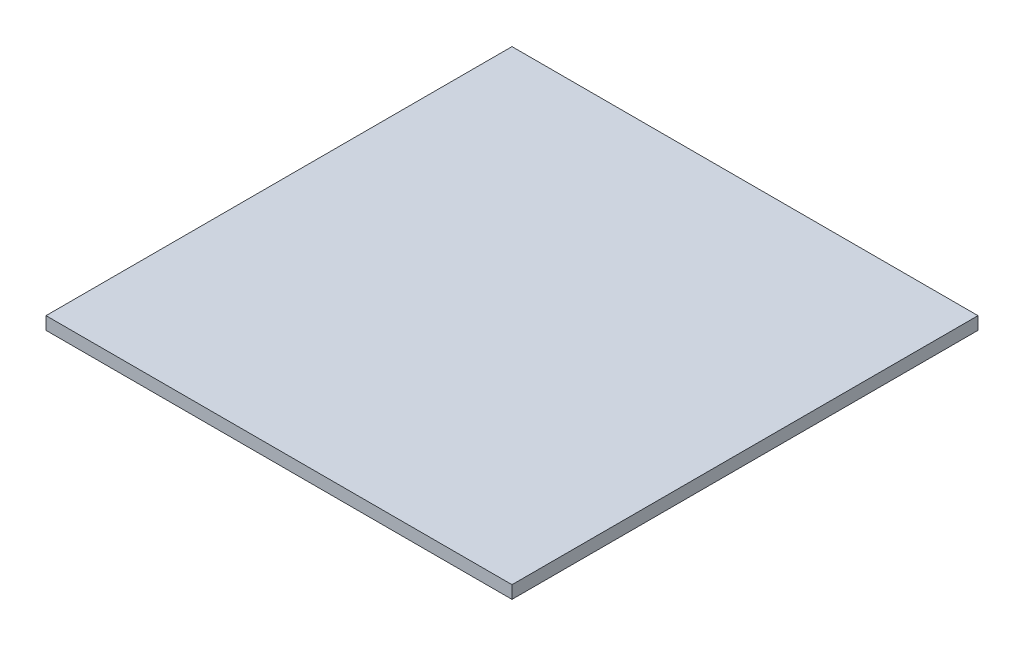
ISO-10303-21;
HEADER;
FILE_DESCRIPTION(('STEP AP214'),'2;1');
FILE_NAME('part.step','',(''),(''),'','','');
FILE_SCHEMA(('AUTOMOTIVE_DESIGN { 1 0 10303 214 1 1 1 1 }'));
ENDSEC;
DATA;
#1=APPLICATION_CONTEXT('core data for automotive mechanical design processes');
#2=APPLICATION_PROTOCOL_DEFINITION('international standard','automotive_design',2000,#1);
#3=PRODUCT_CONTEXT('',#1,'mechanical');
#4=PRODUCT('Part','Part','',(#3));
#5=PRODUCT_RELATED_PRODUCT_CATEGORY('part','',(#4));
#6=PRODUCT_DEFINITION_FORMATION('','',#4);
#7=PRODUCT_DEFINITION_CONTEXT('part definition',#1,'design');
#8=PRODUCT_DEFINITION('design','',#6,#7);
#9=PRODUCT_DEFINITION_SHAPE('','',#8);
#10=(LENGTH_UNIT() NAMED_UNIT(*) SI_UNIT(.MILLI.,.METRE.));
#11=(NAMED_UNIT(*) PLANE_ANGLE_UNIT() SI_UNIT($,.RADIAN.));
#12=(NAMED_UNIT(*) SI_UNIT($,.STERADIAN.) SOLID_ANGLE_UNIT());
#13=UNCERTAINTY_MEASURE_WITH_UNIT(LENGTH_MEASURE(1.E-05),#10,'distance_accuracy_value','');
#14=(GEOMETRIC_REPRESENTATION_CONTEXT(3) GLOBAL_UNCERTAINTY_ASSIGNED_CONTEXT((#13)) GLOBAL_UNIT_ASSIGNED_CONTEXT((#10,
#11,#12)) REPRESENTATION_CONTEXT('',''));
#15=CARTESIAN_POINT('',(0.,0.,0.));
#16=DIRECTION('',(0.,0.,1.));
#17=DIRECTION('',(1.,0.,0.));
#18=AXIS2_PLACEMENT_3D('',#15,#16,#17);
#19=CARTESIAN_POINT('',(-118.587048432742,2.2606,-65.1334894155714));
#20=DIRECTION('',(1.,0.,0.));
#21=DIRECTION('',(0.,0.,-1.));
#22=AXIS2_PLACEMENT_3D('',#19,#20,#21);
#23=PLANE('',#22);
#24=DIRECTION('',(0.,0.,1.));
#25=VECTOR('',#24,1.);
#26=CARTESIAN_POINT('',(-118.587048432742,0.,-65.1334894155714));
#27=LINE('',#26,#25);
#28=CARTESIAN_POINT('',(-118.587048432742,0.,-65.1334894155714));
#29=VERTEX_POINT('',#28);
#30=CARTESIAN_POINT('',(-118.587048432742,0.,17.4165105844286));
#31=VERTEX_POINT('',#30);
#32=EDGE_CURVE('E100',#29,#31,#27,.T.);
#33=ORIENTED_EDGE('',*,*,#32,.T.);
#34=DIRECTION('',(0.,-1.,0.));
#35=VECTOR('',#34,1.);
#36=CARTESIAN_POINT('',(-118.587048432742,2.2606,17.4165105844286));
#37=LINE('',#36,#35);
#38=CARTESIAN_POINT('',(-118.587048432742,2.2606,17.4165105844286));
#39=VERTEX_POINT('',#38);
#40=EDGE_CURVE('E11',#39,#31,#37,.T.);
#41=ORIENTED_EDGE('',*,*,#40,.F.);
#42=DIRECTION('',(0.,0.,1.));
#43=VECTOR('',#42,1.);
#44=CARTESIAN_POINT('',(-118.587048432742,2.2606,-65.1334894155714));
#45=LINE('',#44,#43);
#46=CARTESIAN_POINT('',(-118.587048432742,2.2606,-65.1334894155714));
#47=VERTEX_POINT('',#46);
#48=EDGE_CURVE('E88',#47,#39,#45,.T.);
#49=ORIENTED_EDGE('',*,*,#48,.F.);
#50=DIRECTION('',(0.,-1.,0.));
#51=VECTOR('',#50,1.);
#52=CARTESIAN_POINT('',(-118.587048432742,2.2606,-65.1334894155714));
#53=LINE('',#52,#51);
#54=EDGE_CURVE('E96',#47,#29,#53,.T.);
#55=ORIENTED_EDGE('',*,*,#54,.T.);
#56=EDGE_LOOP('',(#33,#41,#49,#55));
#57=FACE_BOUND('',#56,.T.);
#58=ADVANCED_FACE('F37',(#57),#23,.F.);
#59=CARTESIAN_POINT('',(-118.587048432742,2.2606,17.4165105844286));
#60=DIRECTION('',(0.,0.,-1.));
#61=DIRECTION('',(-1.,0.,0.));
#62=AXIS2_PLACEMENT_3D('',#59,#60,#61);
#63=PLANE('',#62);
#64=DIRECTION('',(1.,0.,0.));
#65=VECTOR('',#64,1.);
#66=CARTESIAN_POINT('',(-118.587048432742,0.,17.4165105844286));
#67=LINE('',#66,#65);
#68=CARTESIAN_POINT('',(-36.0370484327421,0.,17.4165105844286));
#69=VERTEX_POINT('',#68);
#70=EDGE_CURVE('E92',#31,#69,#67,.T.);
#71=ORIENTED_EDGE('',*,*,#70,.T.);
#72=DIRECTION('',(0.,-1.,0.));
#73=VECTOR('',#72,1.);
#74=CARTESIAN_POINT('',(-36.0370484327421,2.2606,17.4165105844286));
#75=LINE('',#74,#73);
#76=CARTESIAN_POINT('',(-36.0370484327421,2.2606,17.4165105844286));
#77=VERTEX_POINT('',#76);
#78=EDGE_CURVE('E45',#77,#69,#75,.T.);
#79=ORIENTED_EDGE('',*,*,#78,.F.);
#80=DIRECTION('',(1.,0.,0.));
#81=VECTOR('',#80,1.);
#82=CARTESIAN_POINT('',(-118.587048432742,2.2606,17.4165105844286));
#83=LINE('',#82,#81);
#84=EDGE_CURVE('E83',#39,#77,#83,.T.);
#85=ORIENTED_EDGE('',*,*,#84,.F.);
#86=ORIENTED_EDGE('',*,*,#40,.T.);
#87=EDGE_LOOP('',(#71,#79,#85,#86));
#88=FACE_BOUND('',#87,.T.);
#89=ADVANCED_FACE('F91',(#88),#63,.F.);
#90=CARTESIAN_POINT('',(-36.0370484327421,2.2606,-65.1334894155714));
#91=DIRECTION('',(-1.,0.,0.));
#92=DIRECTION('',(0.,0.,1.));
#93=AXIS2_PLACEMENT_3D('',#90,#91,#92);
#94=PLANE('',#93);
#95=DIRECTION('',(0.,0.,-1.));
#96=VECTOR('',#95,1.);
#97=CARTESIAN_POINT('',(-36.0370484327421,0.,-65.1334894155714));
#98=LINE('',#97,#96);
#99=CARTESIAN_POINT('',(-36.0370484327421,0.,-65.1334894155714));
#100=VERTEX_POINT('',#99);
#101=EDGE_CURVE('E70',#69,#100,#98,.T.);
#102=ORIENTED_EDGE('',*,*,#101,.T.);
#103=DIRECTION('',(0.,-1.,0.));
#104=VECTOR('',#103,1.);
#105=CARTESIAN_POINT('',(-36.0370484327421,2.2606,-65.1334894155714));
#106=LINE('',#105,#104);
#107=CARTESIAN_POINT('',(-36.0370484327421,2.2606,-65.1334894155714));
#108=VERTEX_POINT('',#107);
#109=EDGE_CURVE('E93',#108,#100,#106,.T.);
#110=ORIENTED_EDGE('',*,*,#109,.F.);
#111=DIRECTION('',(0.,0.,-1.));
#112=VECTOR('',#111,1.);
#113=CARTESIAN_POINT('',(-36.0370484327421,2.2606,-65.1334894155714));
#114=LINE('',#113,#112);
#115=EDGE_CURVE('E86',#77,#108,#114,.T.);
#116=ORIENTED_EDGE('',*,*,#115,.F.);
#117=ORIENTED_EDGE('',*,*,#78,.T.);
#118=EDGE_LOOP('',(#102,#110,#116,#117));
#119=FACE_BOUND('',#118,.T.);
#120=ADVANCED_FACE('F94',(#119),#94,.F.);
#121=CARTESIAN_POINT('',(-118.587048432742,2.2606,-65.1334894155714));
#122=DIRECTION('',(0.,0.,1.));
#123=DIRECTION('',(1.,0.,0.));
#124=AXIS2_PLACEMENT_3D('',#121,#122,#123);
#125=PLANE('',#124);
#126=DIRECTION('',(-1.,0.,0.));
#127=VECTOR('',#126,1.);
#128=CARTESIAN_POINT('',(-118.587048432742,0.,-65.1334894155714));
#129=LINE('',#128,#127);
#130=EDGE_CURVE('E76',#100,#29,#129,.T.);
#131=ORIENTED_EDGE('',*,*,#130,.T.);
#132=ORIENTED_EDGE('',*,*,#54,.F.);
#133=DIRECTION('',(-1.,0.,0.));
#134=VECTOR('',#133,1.);
#135=CARTESIAN_POINT('',(-118.587048432742,2.2606,-65.1334894155714));
#136=LINE('',#135,#134);
#137=EDGE_CURVE('E53',#108,#47,#136,.T.);
#138=ORIENTED_EDGE('',*,*,#137,.F.);
#139=ORIENTED_EDGE('',*,*,#109,.T.);
#140=EDGE_LOOP('',(#131,#132,#138,#139));
#141=FACE_BOUND('',#140,.T.);
#142=ADVANCED_FACE('F107',(#141),#125,.F.);
#143=CARTESIAN_POINT('',(0.,2.2606,0.));
#144=DIRECTION('',(0.,1.,0.));
#145=DIRECTION('',(0.,0.,1.));
#146=AXIS2_PLACEMENT_3D('',#143,#144,#145);
#147=PLANE('',#146);
#148=ORIENTED_EDGE('',*,*,#48,.T.);
#149=ORIENTED_EDGE('',*,*,#84,.T.);
#150=ORIENTED_EDGE('',*,*,#115,.T.);
#151=ORIENTED_EDGE('',*,*,#137,.T.);
#152=EDGE_LOOP('',(#148,#149,#150,#151));
#153=FACE_BOUND('',#152,.T.);
#154=ADVANCED_FACE('F84',(#153),#147,.T.);
#155=CARTESIAN_POINT('',(0.,0.,0.));
#156=DIRECTION('',(0.,1.,0.));
#157=DIRECTION('',(0.,0.,1.));
#158=AXIS2_PLACEMENT_3D('',#155,#156,#157);
#159=PLANE('',#158);
#160=ORIENTED_EDGE('',*,*,#32,.F.);
#161=ORIENTED_EDGE('',*,*,#130,.F.);
#162=ORIENTED_EDGE('',*,*,#101,.F.);
#163=ORIENTED_EDGE('',*,*,#70,.F.);
#164=EDGE_LOOP('',(#160,#161,#162,#163));
#165=FACE_BOUND('',#164,.T.);
#166=ADVANCED_FACE('F110',(#165),#159,.F.);
#167=CLOSED_SHELL('',(#58,#89,#120,#142,#154,#166));
#168=MANIFOLD_SOLID_BREP('B2',#167);
#169=ADVANCED_BREP_SHAPE_REPRESENTATION('',(#18,#168),#14);
#170=SHAPE_DEFINITION_REPRESENTATION(#9,#169);
ENDSEC;
END-ISO-10303-21;
